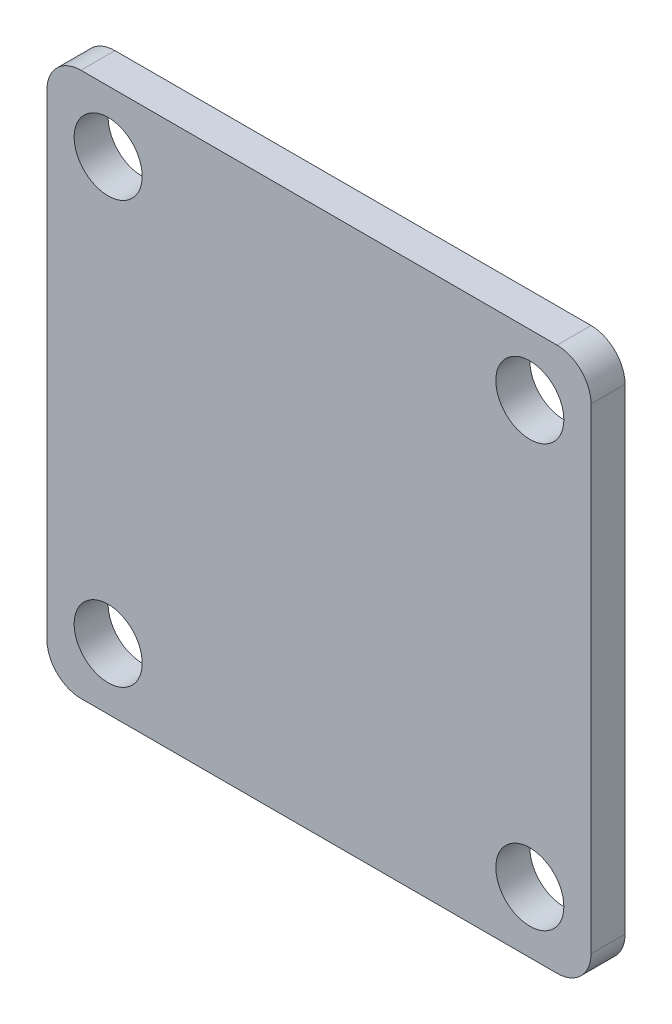
ISO-10303-21;
HEADER;
FILE_DESCRIPTION(('STEP AP214'),'2;1');
FILE_NAME('part.step','',(''),(''),'','','');
FILE_SCHEMA(('AUTOMOTIVE_DESIGN { 1 0 10303 214 1 1 1 1 }'));
ENDSEC;
DATA;
#1=APPLICATION_CONTEXT('core data for automotive mechanical design processes');
#2=APPLICATION_PROTOCOL_DEFINITION('international standard','automotive_design',2000,#1);
#3=PRODUCT_CONTEXT('',#1,'mechanical');
#4=PRODUCT('Part','Part','',(#3));
#5=PRODUCT_RELATED_PRODUCT_CATEGORY('part','',(#4));
#6=PRODUCT_DEFINITION_FORMATION('','',#4);
#7=PRODUCT_DEFINITION_CONTEXT('part definition',#1,'design');
#8=PRODUCT_DEFINITION('design','',#6,#7);
#9=PRODUCT_DEFINITION_SHAPE('','',#8);
#10=(LENGTH_UNIT() NAMED_UNIT(*) SI_UNIT(.MILLI.,.METRE.));
#11=(NAMED_UNIT(*) PLANE_ANGLE_UNIT() SI_UNIT($,.RADIAN.));
#12=(NAMED_UNIT(*) SI_UNIT($,.STERADIAN.) SOLID_ANGLE_UNIT());
#13=UNCERTAINTY_MEASURE_WITH_UNIT(LENGTH_MEASURE(1.E-05),#10,'distance_accuracy_value','');
#14=(GEOMETRIC_REPRESENTATION_CONTEXT(3) GLOBAL_UNCERTAINTY_ASSIGNED_CONTEXT((#13)) GLOBAL_UNIT_ASSIGNED_CONTEXT((#10,
#11,#12)) REPRESENTATION_CONTEXT('',''));
#15=CARTESIAN_POINT('',(0.,0.,0.));
#16=DIRECTION('',(0.,0.,1.));
#17=DIRECTION('',(1.,0.,0.));
#18=AXIS2_PLACEMENT_3D('',#15,#16,#17);
#19=CARTESIAN_POINT('',(-40.,-40.,-5.));
#20=DIRECTION('',(-1.,0.,0.));
#21=DIRECTION('',(0.,0.,1.));
#22=AXIS2_PLACEMENT_3D('',#19,#20,#21);
#23=PLANE('',#22);
#24=DIRECTION('',(0.,-1.,0.));
#25=VECTOR('',#24,1.);
#26=CARTESIAN_POINT('',(-40.,-40.,0.));
#27=LINE('',#26,#25);
#28=CARTESIAN_POINT('',(-40.,35.,0.));
#29=VERTEX_POINT('',#28);
#30=CARTESIAN_POINT('',(-40.,-35.,0.));
#31=VERTEX_POINT('',#30);
#32=EDGE_CURVE('E157',#29,#31,#27,.T.);
#33=ORIENTED_EDGE('',*,*,#32,.F.);
#34=DIRECTION('',(0.,0.,1.));
#35=VECTOR('',#34,1.);
#36=CARTESIAN_POINT('',(-40.,35.,-5.));
#37=LINE('',#36,#35);
#38=CARTESIAN_POINT('',(-40.,35.,-5.));
#39=VERTEX_POINT('',#38);
#40=EDGE_CURVE('E215',#29,#39,#37,.F.);
#41=ORIENTED_EDGE('',*,*,#40,.T.);
#42=DIRECTION('',(0.,-1.,0.));
#43=VECTOR('',#42,1.);
#44=CARTESIAN_POINT('',(-40.,-40.,-5.));
#45=LINE('',#44,#43);
#46=CARTESIAN_POINT('',(-40.,-35.,-5.));
#47=VERTEX_POINT('',#46);
#48=EDGE_CURVE('E126',#39,#47,#45,.T.);
#49=ORIENTED_EDGE('',*,*,#48,.T.);
#50=DIRECTION('',(0.,0.,1.));
#51=VECTOR('',#50,1.);
#52=CARTESIAN_POINT('',(-40.,-35.,-5.));
#53=LINE('',#52,#51);
#54=EDGE_CURVE('E169',#47,#31,#53,.T.);
#55=ORIENTED_EDGE('',*,*,#54,.T.);
#56=EDGE_LOOP('',(#33,#41,#49,#55));
#57=FACE_BOUND('',#56,.T.);
#58=ADVANCED_FACE('F39',(#57),#23,.T.);
#59=CARTESIAN_POINT('',(40.,40.,-5.));
#60=DIRECTION('',(0.,1.,0.));
#61=DIRECTION('',(-1.,0.,0.));
#62=AXIS2_PLACEMENT_3D('',#59,#60,#61);
#63=PLANE('',#62);
#64=DIRECTION('',(-1.,0.,0.));
#65=VECTOR('',#64,1.);
#66=CARTESIAN_POINT('',(40.,40.,-5.));
#67=LINE('',#66,#65);
#68=CARTESIAN_POINT('',(35.,40.,-5.));
#69=VERTEX_POINT('',#68);
#70=CARTESIAN_POINT('',(-35.,40.,-5.));
#71=VERTEX_POINT('',#70);
#72=EDGE_CURVE('E131',#69,#71,#67,.T.);
#73=ORIENTED_EDGE('',*,*,#72,.T.);
#74=DIRECTION('',(0.,0.,1.));
#75=VECTOR('',#74,1.);
#76=CARTESIAN_POINT('',(-35.,40.,-5.));
#77=LINE('',#76,#75);
#78=CARTESIAN_POINT('',(-35.,40.,0.));
#79=VERTEX_POINT('',#78);
#80=EDGE_CURVE('E125',#71,#79,#77,.T.);
#81=ORIENTED_EDGE('',*,*,#80,.T.);
#82=DIRECTION('',(-1.,0.,0.));
#83=VECTOR('',#82,1.);
#84=CARTESIAN_POINT('',(40.,40.,0.));
#85=LINE('',#84,#83);
#86=CARTESIAN_POINT('',(35.,40.,0.));
#87=VERTEX_POINT('',#86);
#88=EDGE_CURVE('E108',#87,#79,#85,.T.);
#89=ORIENTED_EDGE('',*,*,#88,.F.);
#90=DIRECTION('',(0.,0.,1.));
#91=VECTOR('',#90,1.);
#92=CARTESIAN_POINT('',(35.,40.,-5.));
#93=LINE('',#92,#91);
#94=EDGE_CURVE('E122',#87,#69,#93,.F.);
#95=ORIENTED_EDGE('',*,*,#94,.T.);
#96=EDGE_LOOP('',(#73,#81,#89,#95));
#97=FACE_BOUND('',#96,.T.);
#98=ADVANCED_FACE('F121',(#97),#63,.T.);
#99=CARTESIAN_POINT('',(40.,-40.,-5.));
#100=DIRECTION('',(1.,0.,0.));
#101=DIRECTION('',(0.,0.,-1.));
#102=AXIS2_PLACEMENT_3D('',#99,#100,#101);
#103=PLANE('',#102);
#104=DIRECTION('',(0.,1.,0.));
#105=VECTOR('',#104,1.);
#106=CARTESIAN_POINT('',(40.,-40.,-5.));
#107=LINE('',#106,#105);
#108=CARTESIAN_POINT('',(40.,-35.,-5.));
#109=VERTEX_POINT('',#108);
#110=CARTESIAN_POINT('',(40.,35.,-5.));
#111=VERTEX_POINT('',#110);
#112=EDGE_CURVE('E135',#109,#111,#107,.T.);
#113=ORIENTED_EDGE('',*,*,#112,.T.);
#114=DIRECTION('',(0.,0.,1.));
#115=VECTOR('',#114,1.);
#116=CARTESIAN_POINT('',(40.,35.,-5.));
#117=LINE('',#116,#115);
#118=CARTESIAN_POINT('',(40.,35.,0.));
#119=VERTEX_POINT('',#118);
#120=EDGE_CURVE('E206',#111,#119,#117,.T.);
#121=ORIENTED_EDGE('',*,*,#120,.T.);
#122=DIRECTION('',(0.,1.,0.));
#123=VECTOR('',#122,1.);
#124=CARTESIAN_POINT('',(40.,-40.,0.));
#125=LINE('',#124,#123);
#126=CARTESIAN_POINT('',(40.,-35.,0.));
#127=VERTEX_POINT('',#126);
#128=EDGE_CURVE('E110',#127,#119,#125,.T.);
#129=ORIENTED_EDGE('',*,*,#128,.F.);
#130=DIRECTION('',(0.,0.,1.));
#131=VECTOR('',#130,1.);
#132=CARTESIAN_POINT('',(40.,-35.,-5.));
#133=LINE('',#132,#131);
#134=EDGE_CURVE('E204',#127,#109,#133,.F.);
#135=ORIENTED_EDGE('',*,*,#134,.T.);
#136=EDGE_LOOP('',(#113,#121,#129,#135));
#137=FACE_BOUND('',#136,.T.);
#138=ADVANCED_FACE('F205',(#137),#103,.T.);
#139=CARTESIAN_POINT('',(40.,-40.,-5.));
#140=DIRECTION('',(0.,-1.,0.));
#141=DIRECTION('',(1.,0.,0.));
#142=AXIS2_PLACEMENT_3D('',#139,#140,#141);
#143=PLANE('',#142);
#144=DIRECTION('',(1.,0.,0.));
#145=VECTOR('',#144,1.);
#146=CARTESIAN_POINT('',(40.,-40.,-5.));
#147=LINE('',#146,#145);
#148=CARTESIAN_POINT('',(-35.,-40.,-5.));
#149=VERTEX_POINT('',#148);
#150=CARTESIAN_POINT('',(35.,-40.,-5.));
#151=VERTEX_POINT('',#150);
#152=EDGE_CURVE('E187',#149,#151,#147,.T.);
#153=ORIENTED_EDGE('',*,*,#152,.T.);
#154=DIRECTION('',(0.,0.,1.));
#155=VECTOR('',#154,1.);
#156=CARTESIAN_POINT('',(35.,-40.,-5.));
#157=LINE('',#156,#155);
#158=CARTESIAN_POINT('',(35.,-40.,0.));
#159=VERTEX_POINT('',#158);
#160=EDGE_CURVE('E12',#151,#159,#157,.T.);
#161=ORIENTED_EDGE('',*,*,#160,.T.);
#162=DIRECTION('',(1.,0.,0.));
#163=VECTOR('',#162,1.);
#164=CARTESIAN_POINT('',(40.,-40.,0.));
#165=LINE('',#164,#163);
#166=CARTESIAN_POINT('',(-35.,-40.,0.));
#167=VERTEX_POINT('',#166);
#168=EDGE_CURVE('E153',#167,#159,#165,.T.);
#169=ORIENTED_EDGE('',*,*,#168,.F.);
#170=DIRECTION('',(0.,0.,1.));
#171=VECTOR('',#170,1.);
#172=CARTESIAN_POINT('',(-35.,-40.,-5.));
#173=LINE('',#172,#171);
#174=EDGE_CURVE('E47',#167,#149,#173,.F.);
#175=ORIENTED_EDGE('',*,*,#174,.T.);
#176=EDGE_LOOP('',(#153,#161,#169,#175));
#177=FACE_BOUND('',#176,.T.);
#178=ADVANCED_FACE('F199',(#177),#143,.T.);
#179=CARTESIAN_POINT('',(0.,0.,-5.));
#180=DIRECTION('',(0.,0.,1.));
#181=DIRECTION('',(1.,0.,0.));
#182=AXIS2_PLACEMENT_3D('',#179,#180,#181);
#183=PLANE('',#182);
#184=CARTESIAN_POINT('',(-31.,31.,-5.));
#185=DIRECTION('',(0.,0.,1.));
#186=DIRECTION('',(1.,0.,0.));
#187=AXIS2_PLACEMENT_3D('',#184,#185,#186);
#188=CIRCLE('',#187,4.99999999999999);
#189=CARTESIAN_POINT('',(-26.,31.,-5.));
#190=VERTEX_POINT('',#189);
#191=EDGE_CURVE('E138',#190,#190,#188,.T.);
#192=ORIENTED_EDGE('',*,*,#191,.T.);
#193=EDGE_LOOP('',(#192));
#194=FACE_BOUND('',#193,.T.);
#195=CARTESIAN_POINT('',(31.,31.,-5.));
#196=DIRECTION('',(0.,0.,1.));
#197=DIRECTION('',(1.,0.,0.));
#198=AXIS2_PLACEMENT_3D('',#195,#196,#197);
#199=CIRCLE('',#198,4.99999999999999);
#200=CARTESIAN_POINT('',(36.,31.,-5.));
#201=VERTEX_POINT('',#200);
#202=EDGE_CURVE('E228',#201,#201,#199,.T.);
#203=ORIENTED_EDGE('',*,*,#202,.T.);
#204=EDGE_LOOP('',(#203));
#205=FACE_BOUND('',#204,.T.);
#206=CARTESIAN_POINT('',(31.,-31.,-5.));
#207=DIRECTION('',(0.,0.,1.));
#208=DIRECTION('',(1.,0.,0.));
#209=AXIS2_PLACEMENT_3D('',#206,#207,#208);
#210=CIRCLE('',#209,4.99999999999999);
#211=CARTESIAN_POINT('',(36.,-31.,-5.));
#212=VERTEX_POINT('',#211);
#213=EDGE_CURVE('E183',#212,#212,#210,.T.);
#214=ORIENTED_EDGE('',*,*,#213,.T.);
#215=EDGE_LOOP('',(#214));
#216=FACE_BOUND('',#215,.T.);
#217=CARTESIAN_POINT('',(-31.,-31.,-5.));
#218=DIRECTION('',(0.,0.,1.));
#219=DIRECTION('',(1.,0.,0.));
#220=AXIS2_PLACEMENT_3D('',#217,#218,#219);
#221=CIRCLE('',#220,4.99999999999999);
#222=CARTESIAN_POINT('',(-26.,-31.,-5.));
#223=VERTEX_POINT('',#222);
#224=EDGE_CURVE('E182',#223,#223,#221,.T.);
#225=ORIENTED_EDGE('',*,*,#224,.T.);
#226=EDGE_LOOP('',(#225));
#227=FACE_BOUND('',#226,.T.);
#228=ORIENTED_EDGE('',*,*,#48,.F.);
#229=CARTESIAN_POINT('',(-35.,35.,-5.));
#230=DIRECTION('',(0.,0.,1.));
#231=DIRECTION('',(1.,0.,0.));
#232=AXIS2_PLACEMENT_3D('',#229,#230,#231);
#233=CIRCLE('',#232,5.);
#234=EDGE_CURVE('E208',#39,#71,#233,.F.);
#235=ORIENTED_EDGE('',*,*,#234,.T.);
#236=ORIENTED_EDGE('',*,*,#72,.F.);
#237=CARTESIAN_POINT('',(35.,35.,-5.));
#238=DIRECTION('',(0.,0.,1.));
#239=DIRECTION('',(1.,0.,0.));
#240=AXIS2_PLACEMENT_3D('',#237,#238,#239);
#241=CIRCLE('',#240,5.);
#242=EDGE_CURVE('E130',#69,#111,#241,.F.);
#243=ORIENTED_EDGE('',*,*,#242,.T.);
#244=ORIENTED_EDGE('',*,*,#112,.F.);
#245=CARTESIAN_POINT('',(35.,-35.,-5.));
#246=DIRECTION('',(0.,0.,1.));
#247=DIRECTION('',(1.,0.,0.));
#248=AXIS2_PLACEMENT_3D('',#245,#246,#247);
#249=CIRCLE('',#248,5.);
#250=EDGE_CURVE('E54',#109,#151,#249,.F.);
#251=ORIENTED_EDGE('',*,*,#250,.T.);
#252=ORIENTED_EDGE('',*,*,#152,.F.);
#253=CARTESIAN_POINT('',(-35.,-35.,-5.));
#254=DIRECTION('',(0.,0.,1.));
#255=DIRECTION('',(1.,0.,0.));
#256=AXIS2_PLACEMENT_3D('',#253,#254,#255);
#257=CIRCLE('',#256,5.);
#258=EDGE_CURVE('E214',#149,#47,#257,.F.);
#259=ORIENTED_EDGE('',*,*,#258,.T.);
#260=EDGE_LOOP('',(#228,#235,#236,#243,#244,#251,#252,#259));
#261=FACE_BOUND('',#260,.T.);
#262=ADVANCED_FACE('F256',(#194,#205,#216,#227,#261),#183,.F.);
#263=CARTESIAN_POINT('',(0.,0.,0.));
#264=DIRECTION('',(0.,0.,1.));
#265=DIRECTION('',(1.,0.,0.));
#266=AXIS2_PLACEMENT_3D('',#263,#264,#265);
#267=PLANE('',#266);
#268=CARTESIAN_POINT('',(-31.,31.,0.));
#269=DIRECTION('',(0.,0.,1.));
#270=DIRECTION('',(1.,0.,0.));
#271=AXIS2_PLACEMENT_3D('',#268,#269,#270);
#272=CIRCLE('',#271,4.99999999999999);
#273=CARTESIAN_POINT('',(-26.,31.,0.));
#274=VERTEX_POINT('',#273);
#275=EDGE_CURVE('E241',#274,#274,#272,.T.);
#276=ORIENTED_EDGE('',*,*,#275,.F.);
#277=EDGE_LOOP('',(#276));
#278=FACE_BOUND('',#277,.T.);
#279=CARTESIAN_POINT('',(31.,31.,0.));
#280=DIRECTION('',(0.,0.,1.));
#281=DIRECTION('',(1.,0.,0.));
#282=AXIS2_PLACEMENT_3D('',#279,#280,#281);
#283=CIRCLE('',#282,4.99999999999999);
#284=CARTESIAN_POINT('',(36.,31.,0.));
#285=VERTEX_POINT('',#284);
#286=EDGE_CURVE('E232',#285,#285,#283,.T.);
#287=ORIENTED_EDGE('',*,*,#286,.F.);
#288=EDGE_LOOP('',(#287));
#289=FACE_BOUND('',#288,.T.);
#290=CARTESIAN_POINT('',(31.,-31.,0.));
#291=DIRECTION('',(0.,0.,1.));
#292=DIRECTION('',(1.,0.,0.));
#293=AXIS2_PLACEMENT_3D('',#290,#291,#292);
#294=CIRCLE('',#293,4.99999999999999);
#295=CARTESIAN_POINT('',(36.,-31.,0.));
#296=VERTEX_POINT('',#295);
#297=EDGE_CURVE('E231',#296,#296,#294,.T.);
#298=ORIENTED_EDGE('',*,*,#297,.F.);
#299=EDGE_LOOP('',(#298));
#300=FACE_BOUND('',#299,.T.);
#301=CARTESIAN_POINT('',(-31.,-31.,0.));
#302=DIRECTION('',(0.,0.,1.));
#303=DIRECTION('',(1.,0.,0.));
#304=AXIS2_PLACEMENT_3D('',#301,#302,#303);
#305=CIRCLE('',#304,4.99999999999999);
#306=CARTESIAN_POINT('',(-26.,-31.,0.));
#307=VERTEX_POINT('',#306);
#308=EDGE_CURVE('E177',#307,#307,#305,.T.);
#309=ORIENTED_EDGE('',*,*,#308,.F.);
#310=EDGE_LOOP('',(#309));
#311=FACE_BOUND('',#310,.T.);
#312=ORIENTED_EDGE('',*,*,#88,.T.);
#313=CARTESIAN_POINT('',(-35.,35.,0.));
#314=DIRECTION('',(0.,0.,1.));
#315=DIRECTION('',(1.,0.,0.));
#316=AXIS2_PLACEMENT_3D('',#313,#314,#315);
#317=CIRCLE('',#316,5.);
#318=EDGE_CURVE('E115',#79,#29,#317,.T.);
#319=ORIENTED_EDGE('',*,*,#318,.T.);
#320=ORIENTED_EDGE('',*,*,#32,.T.);
#321=CARTESIAN_POINT('',(-35.,-35.,0.));
#322=DIRECTION('',(0.,0.,1.));
#323=DIRECTION('',(1.,0.,0.));
#324=AXIS2_PLACEMENT_3D('',#321,#322,#323);
#325=CIRCLE('',#324,5.);
#326=EDGE_CURVE('E133',#31,#167,#325,.T.);
#327=ORIENTED_EDGE('',*,*,#326,.T.);
#328=ORIENTED_EDGE('',*,*,#168,.T.);
#329=CARTESIAN_POINT('',(35.,-35.,0.));
#330=DIRECTION('',(0.,0.,1.));
#331=DIRECTION('',(1.,0.,0.));
#332=AXIS2_PLACEMENT_3D('',#329,#330,#331);
#333=CIRCLE('',#332,5.);
#334=EDGE_CURVE('E116',#159,#127,#333,.T.);
#335=ORIENTED_EDGE('',*,*,#334,.T.);
#336=ORIENTED_EDGE('',*,*,#128,.T.);
#337=CARTESIAN_POINT('',(35.,35.,0.));
#338=DIRECTION('',(0.,0.,1.));
#339=DIRECTION('',(1.,0.,0.));
#340=AXIS2_PLACEMENT_3D('',#337,#338,#339);
#341=CIRCLE('',#340,5.);
#342=EDGE_CURVE('E105',#119,#87,#341,.T.);
#343=ORIENTED_EDGE('',*,*,#342,.T.);
#344=EDGE_LOOP('',(#312,#319,#320,#327,#328,#335,#336,#343));
#345=FACE_BOUND('',#344,.T.);
#346=ADVANCED_FACE('F107',(#278,#289,#300,#311,#345),#267,.T.);
#347=CARTESIAN_POINT('',(-31.,-31.,0.));
#348=DIRECTION('',(0.,0.,1.));
#349=DIRECTION('',(1.,0.,0.));
#350=AXIS2_PLACEMENT_3D('',#347,#348,#349);
#351=CYLINDRICAL_SURFACE('',#350,4.99999999999999);
#352=ORIENTED_EDGE('',*,*,#308,.T.);
#353=EDGE_LOOP('',(#352));
#354=FACE_BOUND('',#353,.T.);
#355=ORIENTED_EDGE('',*,*,#224,.F.);
#356=EDGE_LOOP('',(#355));
#357=FACE_BOUND('',#356,.T.);
#358=ADVANCED_FACE('F255',(#354,#357),#351,.F.);
#359=CARTESIAN_POINT('',(31.,-31.,0.));
#360=DIRECTION('',(0.,0.,1.));
#361=DIRECTION('',(1.,0.,0.));
#362=AXIS2_PLACEMENT_3D('',#359,#360,#361);
#363=CYLINDRICAL_SURFACE('',#362,4.99999999999999);
#364=ORIENTED_EDGE('',*,*,#297,.T.);
#365=EDGE_LOOP('',(#364));
#366=FACE_BOUND('',#365,.T.);
#367=ORIENTED_EDGE('',*,*,#213,.F.);
#368=EDGE_LOOP('',(#367));
#369=FACE_BOUND('',#368,.T.);
#370=ADVANCED_FACE('F265',(#366,#369),#363,.F.);
#371=CARTESIAN_POINT('',(31.,31.,0.));
#372=DIRECTION('',(0.,0.,1.));
#373=DIRECTION('',(1.,0.,0.));
#374=AXIS2_PLACEMENT_3D('',#371,#372,#373);
#375=CYLINDRICAL_SURFACE('',#374,4.99999999999999);
#376=ORIENTED_EDGE('',*,*,#286,.T.);
#377=EDGE_LOOP('',(#376));
#378=FACE_BOUND('',#377,.T.);
#379=ORIENTED_EDGE('',*,*,#202,.F.);
#380=EDGE_LOOP('',(#379));
#381=FACE_BOUND('',#380,.T.);
#382=ADVANCED_FACE('F270',(#378,#381),#375,.F.);
#383=CARTESIAN_POINT('',(-31.,31.,0.));
#384=DIRECTION('',(0.,0.,1.));
#385=DIRECTION('',(1.,0.,0.));
#386=AXIS2_PLACEMENT_3D('',#383,#384,#385);
#387=CYLINDRICAL_SURFACE('',#386,4.99999999999999);
#388=ORIENTED_EDGE('',*,*,#275,.T.);
#389=EDGE_LOOP('',(#388));
#390=FACE_BOUND('',#389,.T.);
#391=ORIENTED_EDGE('',*,*,#191,.F.);
#392=EDGE_LOOP('',(#391));
#393=FACE_BOUND('',#392,.T.);
#394=ADVANCED_FACE('F250',(#390,#393),#387,.F.);
#395=CARTESIAN_POINT('',(-35.,35.,-5.));
#396=DIRECTION('',(0.,0.,1.));
#397=DIRECTION('',(1.,0.,0.));
#398=AXIS2_PLACEMENT_3D('',#395,#396,#397);
#399=CYLINDRICAL_SURFACE('',#398,5.);
#400=ORIENTED_EDGE('',*,*,#234,.F.);
#401=ORIENTED_EDGE('',*,*,#40,.F.);
#402=ORIENTED_EDGE('',*,*,#318,.F.);
#403=ORIENTED_EDGE('',*,*,#80,.F.);
#404=EDGE_LOOP('',(#400,#401,#402,#403));
#405=FACE_BOUND('',#404,.T.);
#406=ADVANCED_FACE('F283',(#405),#399,.T.);
#407=CARTESIAN_POINT('',(35.,35.,-5.));
#408=DIRECTION('',(0.,0.,1.));
#409=DIRECTION('',(1.,0.,0.));
#410=AXIS2_PLACEMENT_3D('',#407,#408,#409);
#411=CYLINDRICAL_SURFACE('',#410,5.);
#412=ORIENTED_EDGE('',*,*,#242,.F.);
#413=ORIENTED_EDGE('',*,*,#94,.F.);
#414=ORIENTED_EDGE('',*,*,#342,.F.);
#415=ORIENTED_EDGE('',*,*,#120,.F.);
#416=EDGE_LOOP('',(#412,#413,#414,#415));
#417=FACE_BOUND('',#416,.T.);
#418=ADVANCED_FACE('F129',(#417),#411,.T.);
#419=CARTESIAN_POINT('',(35.,-35.,-5.));
#420=DIRECTION('',(0.,0.,1.));
#421=DIRECTION('',(1.,0.,0.));
#422=AXIS2_PLACEMENT_3D('',#419,#420,#421);
#423=CYLINDRICAL_SURFACE('',#422,5.);
#424=ORIENTED_EDGE('',*,*,#250,.F.);
#425=ORIENTED_EDGE('',*,*,#134,.F.);
#426=ORIENTED_EDGE('',*,*,#334,.F.);
#427=ORIENTED_EDGE('',*,*,#160,.F.);
#428=EDGE_LOOP('',(#424,#425,#426,#427));
#429=FACE_BOUND('',#428,.T.);
#430=ADVANCED_FACE('F202',(#429),#423,.T.);
#431=CARTESIAN_POINT('',(-35.,-35.,-5.));
#432=DIRECTION('',(0.,0.,1.));
#433=DIRECTION('',(1.,0.,0.));
#434=AXIS2_PLACEMENT_3D('',#431,#432,#433);
#435=CYLINDRICAL_SURFACE('',#434,5.);
#436=ORIENTED_EDGE('',*,*,#258,.F.);
#437=ORIENTED_EDGE('',*,*,#174,.F.);
#438=ORIENTED_EDGE('',*,*,#326,.F.);
#439=ORIENTED_EDGE('',*,*,#54,.F.);
#440=EDGE_LOOP('',(#436,#437,#438,#439));
#441=FACE_BOUND('',#440,.T.);
#442=ADVANCED_FACE('F41',(#441),#435,.T.);
#443=CLOSED_SHELL('',(#58,#98,#138,#178,#262,#346,#358,#370,#382,#394,#406,#418,#430,#442));
#444=MANIFOLD_SOLID_BREP('B2',#443);
#445=ADVANCED_BREP_SHAPE_REPRESENTATION('',(#18,#444),#14);
#446=SHAPE_DEFINITION_REPRESENTATION(#9,#445);
ENDSEC;
END-ISO-10303-21;
